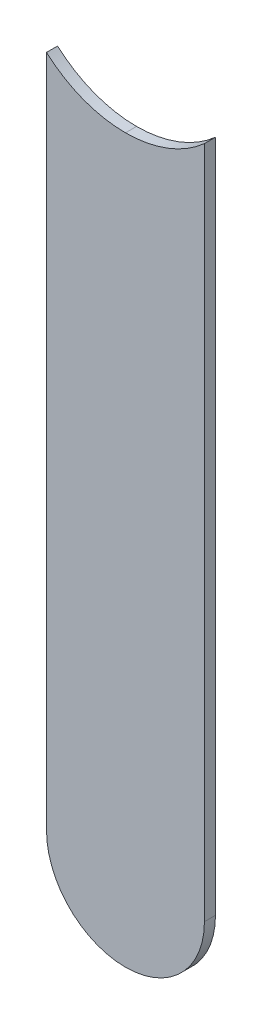
ISO-10303-21;
HEADER;
FILE_DESCRIPTION(('STEP AP214'),'2;1');
FILE_NAME('part.step','',(''),(''),'','','');
FILE_SCHEMA(('AUTOMOTIVE_DESIGN { 1 0 10303 214 1 1 1 1 }'));
ENDSEC;
DATA;
#1=APPLICATION_CONTEXT('core data for automotive mechanical design processes');
#2=APPLICATION_PROTOCOL_DEFINITION('international standard','automotive_design',2000,#1);
#3=PRODUCT_CONTEXT('',#1,'mechanical');
#4=PRODUCT('Part','Part','',(#3));
#5=PRODUCT_RELATED_PRODUCT_CATEGORY('part','',(#4));
#6=PRODUCT_DEFINITION_FORMATION('','',#4);
#7=PRODUCT_DEFINITION_CONTEXT('part definition',#1,'design');
#8=PRODUCT_DEFINITION('design','',#6,#7);
#9=PRODUCT_DEFINITION_SHAPE('','',#8);
#10=(LENGTH_UNIT() NAMED_UNIT(*) SI_UNIT(.MILLI.,.METRE.));
#11=(NAMED_UNIT(*) PLANE_ANGLE_UNIT() SI_UNIT($,.RADIAN.));
#12=(NAMED_UNIT(*) SI_UNIT($,.STERADIAN.) SOLID_ANGLE_UNIT());
#13=UNCERTAINTY_MEASURE_WITH_UNIT(LENGTH_MEASURE(1.E-05),#10,'distance_accuracy_value','');
#14=(GEOMETRIC_REPRESENTATION_CONTEXT(3) GLOBAL_UNCERTAINTY_ASSIGNED_CONTEXT((#13)) GLOBAL_UNIT_ASSIGNED_CONTEXT((#10,
#11,#12)) REPRESENTATION_CONTEXT('',''));
#15=CARTESIAN_POINT('',(0.,0.,0.));
#16=DIRECTION('',(0.,0.,1.));
#17=DIRECTION('',(1.,0.,0.));
#18=AXIS2_PLACEMENT_3D('',#15,#16,#17);
#19=CARTESIAN_POINT('',(152.4,-103.632,-0.045));
#20=DIRECTION('',(0.,0.,-1.));
#21=DIRECTION('',(0.,-1.,0.));
#22=AXIS2_PLACEMENT_3D('',#19,#20,#21);
#23=CYLINDRICAL_SURFACE('',#22,0.375);
#24=DIRECTION('',(0.,0.,1.));
#25=VECTOR('',#24,1.);
#26=CARTESIAN_POINT('',(152.4,-104.007,-0.045));
#27=LINE('',#26,#25);
#28=CARTESIAN_POINT('',(152.4,-104.007,-0.035));
#29=VERTEX_POINT('',#28);
#30=CARTESIAN_POINT('',(152.4,-104.007,0.));
#31=VERTEX_POINT('',#30);
#32=EDGE_CURVE('E81',#29,#31,#27,.T.);
#33=ORIENTED_EDGE('',*,*,#32,.F.);
#34=CARTESIAN_POINT('',(152.4,-103.632,-0.035));
#35=DIRECTION('',(0.,0.,-1.));
#36=DIRECTION('',(0.,-1.,0.));
#37=AXIS2_PLACEMENT_3D('',#34,#35,#36);
#38=CIRCLE('',#37,0.375);
#39=CARTESIAN_POINT('',(152.15,-103.9115084971,-0.035));
#40=VERTEX_POINT('',#39);
#41=EDGE_CURVE('E114',#29,#40,#38,.T.);
#42=ORIENTED_EDGE('',*,*,#41,.T.);
#43=DIRECTION('',(0.,0.,-1.));
#44=VECTOR('',#43,1.);
#45=CARTESIAN_POINT('',(152.15,-103.9115084971,-0.045));
#46=LINE('',#45,#44);
#47=CARTESIAN_POINT('',(152.15,-103.9115084971,0.));
#48=VERTEX_POINT('',#47);
#49=EDGE_CURVE('E11',#48,#40,#46,.T.);
#50=ORIENTED_EDGE('',*,*,#49,.F.);
#51=CARTESIAN_POINT('',(152.4,-103.632,0.));
#52=DIRECTION('',(0.,0.,-1.));
#53=DIRECTION('',(0.,-1.,0.));
#54=AXIS2_PLACEMENT_3D('',#51,#52,#53);
#55=CIRCLE('',#54,0.375);
#56=EDGE_CURVE('E118',#31,#48,#55,.T.);
#57=ORIENTED_EDGE('',*,*,#56,.F.);
#58=EDGE_LOOP('',(#33,#42,#50,#57));
#59=FACE_BOUND('',#58,.T.);
#60=ADVANCED_FACE('F17',(#59),#23,.F.);
#61=CARTESIAN_POINT('',(152.15,-103.632,-0.035));
#62=DIRECTION('',(1.,0.,0.));
#63=DIRECTION('',(0.,1.,0.));
#64=AXIS2_PLACEMENT_3D('',#61,#62,#63);
#65=PLANE('',#64);
#66=DIRECTION('',(0.,0.,1.));
#67=VECTOR('',#66,1.);
#68=CARTESIAN_POINT('',(152.15,-106.045,-0.035));
#69=LINE('',#68,#67);
#70=CARTESIAN_POINT('',(152.15,-106.045,-0.035));
#71=VERTEX_POINT('',#70);
#72=CARTESIAN_POINT('',(152.15,-106.045,0.));
#73=VERTEX_POINT('',#72);
#74=EDGE_CURVE('E27',#71,#73,#69,.T.);
#75=ORIENTED_EDGE('',*,*,#74,.T.);
#76=DIRECTION('',(0.,-1.,0.));
#77=VECTOR('',#76,1.);
#78=CARTESIAN_POINT('',(152.15,-103.632,0.));
#79=LINE('',#78,#77);
#80=EDGE_CURVE('E115',#48,#73,#79,.T.);
#81=ORIENTED_EDGE('',*,*,#80,.F.);
#82=ORIENTED_EDGE('',*,*,#49,.T.);
#83=DIRECTION('',(0.,-1.,0.));
#84=VECTOR('',#83,1.);
#85=CARTESIAN_POINT('',(152.15,-103.632,-0.035));
#86=LINE('',#85,#84);
#87=EDGE_CURVE('E109',#40,#71,#86,.T.);
#88=ORIENTED_EDGE('',*,*,#87,.T.);
#89=EDGE_LOOP('',(#75,#81,#82,#88));
#90=FACE_BOUND('',#89,.T.);
#91=ADVANCED_FACE('F220',(#90),#65,.F.);
#92=CARTESIAN_POINT('',(152.4,-106.045,-0.035));
#93=DIRECTION('',(0.,0.,-1.));
#94=DIRECTION('',(-1.,0.,0.));
#95=AXIS2_PLACEMENT_3D('',#92,#93,#94);
#96=CYLINDRICAL_SURFACE('',#95,0.25);
#97=CARTESIAN_POINT('',(152.4,-106.045,-0.035));
#98=DIRECTION('',(0.,0.,1.));
#99=DIRECTION('',(-1.,0.,0.));
#100=AXIS2_PLACEMENT_3D('',#97,#98,#99);
#101=CIRCLE('',#100,0.25);
#102=CARTESIAN_POINT('',(152.65,-106.045,-0.035));
#103=VERTEX_POINT('',#102);
#104=EDGE_CURVE('E124',#71,#103,#101,.T.);
#105=ORIENTED_EDGE('',*,*,#104,.T.);
#106=DIRECTION('',(0.,0.,1.));
#107=VECTOR('',#106,1.);
#108=CARTESIAN_POINT('',(152.65,-106.045,-0.035));
#109=LINE('',#108,#107);
#110=CARTESIAN_POINT('',(152.65,-106.045,0.));
#111=VERTEX_POINT('',#110);
#112=EDGE_CURVE('E94',#103,#111,#109,.T.);
#113=ORIENTED_EDGE('',*,*,#112,.T.);
#114=CARTESIAN_POINT('',(152.4,-106.045,0.));
#115=DIRECTION('',(0.,0.,1.));
#116=DIRECTION('',(-1.,0.,0.));
#117=AXIS2_PLACEMENT_3D('',#114,#115,#116);
#118=CIRCLE('',#117,0.25);
#119=EDGE_CURVE('E20',#73,#111,#118,.T.);
#120=ORIENTED_EDGE('',*,*,#119,.F.);
#121=ORIENTED_EDGE('',*,*,#74,.F.);
#122=EDGE_LOOP('',(#105,#113,#120,#121));
#123=FACE_BOUND('',#122,.T.);
#124=ADVANCED_FACE('F211',(#123),#96,.T.);
#125=CARTESIAN_POINT('',(152.65,-106.045,0.));
#126=DIRECTION('',(0.,0.,1.));
#127=DIRECTION('',(1.,0.,0.));
#128=AXIS2_PLACEMENT_3D('',#125,#126,#127);
#129=PLANE('',#128);
#130=ORIENTED_EDGE('',*,*,#119,.T.);
#131=DIRECTION('',(0.,1.,0.));
#132=VECTOR('',#131,1.);
#133=CARTESIAN_POINT('',(152.65,-106.045,0.));
#134=LINE('',#133,#132);
#135=CARTESIAN_POINT('',(152.65,-103.9115084971,0.));
#136=VERTEX_POINT('',#135);
#137=EDGE_CURVE('E86',#111,#136,#134,.T.);
#138=ORIENTED_EDGE('',*,*,#137,.T.);
#139=CARTESIAN_POINT('',(152.4,-103.632,0.));
#140=DIRECTION('',(0.,0.,-1.));
#141=DIRECTION('',(0.,-1.,0.));
#142=AXIS2_PLACEMENT_3D('',#139,#140,#141);
#143=CIRCLE('',#142,0.375);
#144=EDGE_CURVE('E74',#136,#31,#143,.T.);
#145=ORIENTED_EDGE('',*,*,#144,.T.);
#146=ORIENTED_EDGE('',*,*,#56,.T.);
#147=ORIENTED_EDGE('',*,*,#80,.T.);
#148=EDGE_LOOP('',(#130,#138,#145,#146,#147));
#149=FACE_BOUND('',#148,.T.);
#150=ADVANCED_FACE('F87',(#149),#129,.T.);
#151=CARTESIAN_POINT('',(152.4,-103.632,-0.045));
#152=DIRECTION('',(0.,0.,-1.));
#153=DIRECTION('',(0.,-1.,0.));
#154=AXIS2_PLACEMENT_3D('',#151,#152,#153);
#155=CYLINDRICAL_SURFACE('',#154,0.375);
#156=CARTESIAN_POINT('',(152.4,-103.632,-0.035));
#157=DIRECTION('',(0.,0.,-1.));
#158=DIRECTION('',(0.,-1.,0.));
#159=AXIS2_PLACEMENT_3D('',#156,#157,#158);
#160=CIRCLE('',#159,0.375);
#161=CARTESIAN_POINT('',(152.65,-103.9115084971,-0.035));
#162=VERTEX_POINT('',#161);
#163=EDGE_CURVE('E121',#162,#29,#160,.T.);
#164=ORIENTED_EDGE('',*,*,#163,.T.);
#165=ORIENTED_EDGE('',*,*,#32,.T.);
#166=ORIENTED_EDGE('',*,*,#144,.F.);
#167=DIRECTION('',(0.,0.,-1.));
#168=VECTOR('',#167,1.);
#169=CARTESIAN_POINT('',(152.65,-103.9115084971,-0.045));
#170=LINE('',#169,#168);
#171=EDGE_CURVE('E79',#136,#162,#170,.T.);
#172=ORIENTED_EDGE('',*,*,#171,.T.);
#173=EDGE_LOOP('',(#164,#165,#166,#172));
#174=FACE_BOUND('',#173,.T.);
#175=ADVANCED_FACE('F77',(#174),#155,.F.);
#176=CARTESIAN_POINT('',(152.65,-106.045,-0.035));
#177=DIRECTION('',(0.,0.,1.));
#178=DIRECTION('',(1.,0.,0.));
#179=AXIS2_PLACEMENT_3D('',#176,#177,#178);
#180=PLANE('',#179);
#181=ORIENTED_EDGE('',*,*,#87,.F.);
#182=ORIENTED_EDGE('',*,*,#41,.F.);
#183=ORIENTED_EDGE('',*,*,#163,.F.);
#184=DIRECTION('',(0.,1.,0.));
#185=VECTOR('',#184,1.);
#186=CARTESIAN_POINT('',(152.65,-106.045,-0.035));
#187=LINE('',#186,#185);
#188=EDGE_CURVE('E99',#103,#162,#187,.T.);
#189=ORIENTED_EDGE('',*,*,#188,.F.);
#190=ORIENTED_EDGE('',*,*,#104,.F.);
#191=EDGE_LOOP('',(#181,#182,#183,#189,#190));
#192=FACE_BOUND('',#191,.T.);
#193=ADVANCED_FACE('F185',(#192),#180,.F.);
#194=CARTESIAN_POINT('',(152.65,-106.045,-0.035));
#195=DIRECTION('',(-1.,0.,0.));
#196=DIRECTION('',(0.,0.,1.));
#197=AXIS2_PLACEMENT_3D('',#194,#195,#196);
#198=PLANE('',#197);
#199=ORIENTED_EDGE('',*,*,#171,.F.);
#200=ORIENTED_EDGE('',*,*,#137,.F.);
#201=ORIENTED_EDGE('',*,*,#112,.F.);
#202=ORIENTED_EDGE('',*,*,#188,.T.);
#203=EDGE_LOOP('',(#199,#200,#201,#202));
#204=FACE_BOUND('',#203,.T.);
#205=ADVANCED_FACE('F97',(#204),#198,.F.);
#206=CLOSED_SHELL('',(#60,#91,#124,#150,#175,#193,#205));
#207=MANIFOLD_SOLID_BREP('B1',#206);
#208=ADVANCED_BREP_SHAPE_REPRESENTATION('',(#18,#207),#14);
#209=SHAPE_DEFINITION_REPRESENTATION(#9,#208);
ENDSEC;
END-ISO-10303-21;
